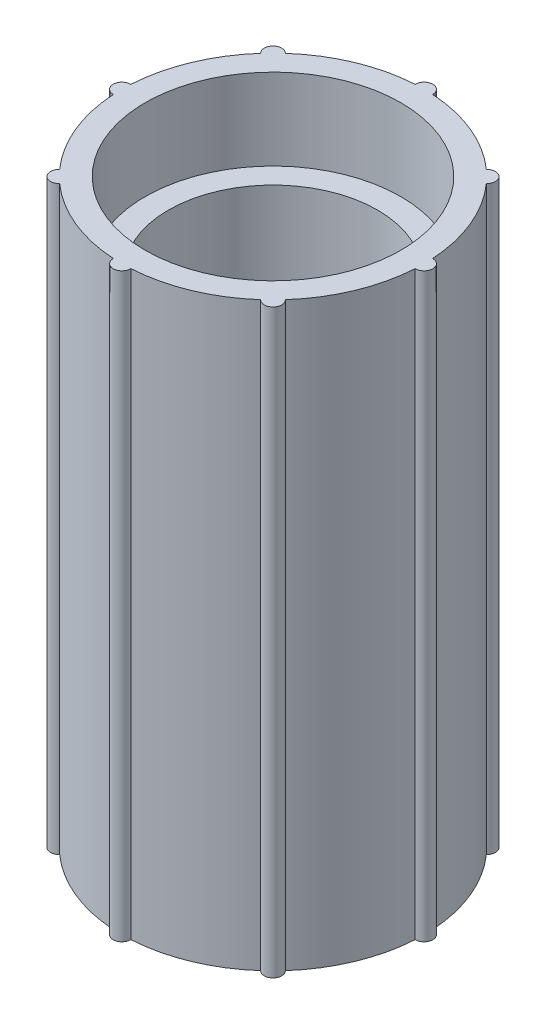
ISO-10303-21;
HEADER;
FILE_DESCRIPTION(('STEP AP214'),'2;1');
FILE_NAME('part.step','',(''),(''),'','','');
FILE_SCHEMA(('AUTOMOTIVE_DESIGN { 1 0 10303 214 1 1 1 1 }'));
ENDSEC;
DATA;
#1=APPLICATION_CONTEXT('core data for automotive mechanical design processes');
#2=APPLICATION_PROTOCOL_DEFINITION('international standard','automotive_design',2000,#1);
#3=PRODUCT_CONTEXT('',#1,'mechanical');
#4=PRODUCT('Part','Part','',(#3));
#5=PRODUCT_RELATED_PRODUCT_CATEGORY('part','',(#4));
#6=PRODUCT_DEFINITION_FORMATION('','',#4);
#7=PRODUCT_DEFINITION_CONTEXT('part definition',#1,'design');
#8=PRODUCT_DEFINITION('design','',#6,#7);
#9=PRODUCT_DEFINITION_SHAPE('','',#8);
#10=(LENGTH_UNIT() NAMED_UNIT(*) SI_UNIT(.MILLI.,.METRE.));
#11=(NAMED_UNIT(*) PLANE_ANGLE_UNIT() SI_UNIT($,.RADIAN.));
#12=(NAMED_UNIT(*) SI_UNIT($,.STERADIAN.) SOLID_ANGLE_UNIT());
#13=UNCERTAINTY_MEASURE_WITH_UNIT(LENGTH_MEASURE(1.E-05),#10,'distance_accuracy_value','');
#14=(GEOMETRIC_REPRESENTATION_CONTEXT(3) GLOBAL_UNCERTAINTY_ASSIGNED_CONTEXT((#13)) GLOBAL_UNIT_ASSIGNED_CONTEXT((#10,
#11,#12)) REPRESENTATION_CONTEXT('',''));
#15=CARTESIAN_POINT('',(0.,0.,0.));
#16=DIRECTION('',(0.,0.,1.));
#17=DIRECTION('',(1.,0.,0.));
#18=AXIS2_PLACEMENT_3D('',#15,#16,#17);
#19=CARTESIAN_POINT('',(0.,25.,0.));
#20=DIRECTION('',(0.,-1.,0.));
#21=DIRECTION('',(0.,0.,-1.));
#22=AXIS2_PLACEMENT_3D('',#19,#20,#21);
#23=CYLINDRICAL_SURFACE('',#22,13.);
#24=DIRECTION('',(0.,-1.,0.));
#25=VECTOR('',#24,1.);
#26=CARTESIAN_POINT('',(8.64698077619624,12.5,9.70719956816036));
#27=LINE('',#26,#25);
#28=CARTESIAN_POINT('',(8.64698077619625,0.,9.70719956816034));
#29=VERTEX_POINT('',#28);
#30=CARTESIAN_POINT('',(8.64698077619624,50.,9.70719956816036));
#31=VERTEX_POINT('',#30);
#32=EDGE_CURVE('E152',#29,#31,#27,.F.);
#33=ORIENTED_EDGE('',*,*,#32,.T.);
#34=CARTESIAN_POINT('',(0.,50.,0.));
#35=DIRECTION('',(0.,1.,0.));
#36=DIRECTION('',(0.,0.,1.));
#37=AXIS2_PLACEMENT_3D('',#34,#35,#36);
#38=CIRCLE('',#37,13.);
#39=CARTESIAN_POINT('',(0.749687897339529,50.,12.9783653846154));
#40=VERTEX_POINT('',#39);
#41=EDGE_CURVE('E155',#40,#31,#38,.T.);
#42=ORIENTED_EDGE('',*,*,#41,.F.);
#43=DIRECTION('',(0.,-1.,0.));
#44=VECTOR('',#43,1.);
#45=CARTESIAN_POINT('',(0.749687897339529,12.5,12.9783653846154));
#46=LINE('',#45,#44);
#47=CARTESIAN_POINT('',(0.749687897339529,0.,12.9783653846154));
#48=VERTEX_POINT('',#47);
#49=EDGE_CURVE('E191',#40,#48,#46,.T.);
#50=ORIENTED_EDGE('',*,*,#49,.T.);
#51=CARTESIAN_POINT('',(0.,0.,0.));
#52=DIRECTION('',(0.,1.,0.));
#53=DIRECTION('',(0.,0.,1.));
#54=AXIS2_PLACEMENT_3D('',#51,#52,#53);
#55=CIRCLE('',#54,13.);
#56=EDGE_CURVE('E57',#48,#29,#55,.T.);
#57=ORIENTED_EDGE('',*,*,#56,.T.);
#58=EDGE_LOOP('',(#33,#42,#50,#57));
#59=FACE_BOUND('',#58,.T.);
#60=ADVANCED_FACE('F39',(#59),#23,.T.);
#61=CARTESIAN_POINT('',(9.70719956816057,50.,8.646980776196));
#62=VERTEX_POINT('',#61);
#63=CARTESIAN_POINT('',(12.9783653846154,50.,0.749687897339393));
#64=VERTEX_POINT('',#63);
#65=EDGE_CURVE('E176',#62,#64,#38,.T.);
#66=ORIENTED_EDGE('',*,*,#65,.F.);
#67=DIRECTION('',(0.,-1.,0.));
#68=VECTOR('',#67,1.);
#69=CARTESIAN_POINT('',(9.70719956816057,12.5,8.646980776196));
#70=LINE('',#69,#68);
#71=CARTESIAN_POINT('',(9.70719956816057,0.,8.646980776196));
#72=VERTEX_POINT('',#71);
#73=EDGE_CURVE('E160',#62,#72,#70,.T.);
#74=ORIENTED_EDGE('',*,*,#73,.T.);
#75=CARTESIAN_POINT('',(12.9783653846154,0.,0.749687897339376));
#76=VERTEX_POINT('',#75);
#77=EDGE_CURVE('E50',#72,#76,#55,.T.);
#78=ORIENTED_EDGE('',*,*,#77,.T.);
#79=DIRECTION('',(0.,-1.,0.));
#80=VECTOR('',#79,1.);
#81=CARTESIAN_POINT('',(12.9783653846154,12.5,0.749687897339393));
#82=LINE('',#81,#80);
#83=EDGE_CURVE('E239',#76,#64,#82,.F.);
#84=ORIENTED_EDGE('',*,*,#83,.T.);
#85=EDGE_LOOP('',(#66,#74,#78,#84));
#86=FACE_BOUND('',#85,.T.);
#87=ADVANCED_FACE('F314',(#86),#23,.T.);
#88=DIRECTION('',(0.,-1.,0.));
#89=VECTOR('',#88,1.);
#90=CARTESIAN_POINT('',(-0.749687897339257,12.5,12.9783653846154));
#91=LINE('',#90,#89);
#92=CARTESIAN_POINT('',(-0.74968789733924,0.,12.9783653846154));
#93=VERTEX_POINT('',#92);
#94=CARTESIAN_POINT('',(-0.749687897339257,50.,12.9783653846154));
#95=VERTEX_POINT('',#94);
#96=EDGE_CURVE('E193',#93,#95,#91,.F.);
#97=ORIENTED_EDGE('',*,*,#96,.T.);
#98=CARTESIAN_POINT('',(-8.64698077619604,50.,9.70719956816054));
#99=VERTEX_POINT('',#98);
#100=EDGE_CURVE('E175',#99,#95,#38,.T.);
#101=ORIENTED_EDGE('',*,*,#100,.F.);
#102=DIRECTION('',(0.,-1.,0.));
#103=VECTOR('',#102,1.);
#104=CARTESIAN_POINT('',(-8.64698077619604,12.5,9.70719956816054));
#105=LINE('',#104,#103);
#106=CARTESIAN_POINT('',(-8.64698077619604,0.,9.70719956816054));
#107=VERTEX_POINT('',#106);
#108=EDGE_CURVE('E198',#99,#107,#105,.T.);
#109=ORIENTED_EDGE('',*,*,#108,.T.);
#110=EDGE_CURVE('E65',#107,#93,#55,.T.);
#111=ORIENTED_EDGE('',*,*,#110,.T.);
#112=EDGE_LOOP('',(#97,#101,#109,#111));
#113=FACE_BOUND('',#112,.T.);
#114=ADVANCED_FACE('F319',(#113),#23,.T.);
#115=DIRECTION('',(0.,-1.,0.));
#116=VECTOR('',#115,1.);
#117=CARTESIAN_POINT('',(-9.70719956816039,12.5,8.64698077619621));
#118=LINE('',#117,#116);
#119=CARTESIAN_POINT('',(-9.70719956816037,0.,8.64698077619622));
#120=VERTEX_POINT('',#119);
#121=CARTESIAN_POINT('',(-9.70719956816039,50.,8.64698077619621));
#122=VERTEX_POINT('',#121);
#123=EDGE_CURVE('E200',#120,#122,#118,.F.);
#124=ORIENTED_EDGE('',*,*,#123,.T.);
#125=CARTESIAN_POINT('',(-12.9783653846154,50.,0.749687897339393));
#126=VERTEX_POINT('',#125);
#127=EDGE_CURVE('E178',#126,#122,#38,.T.);
#128=ORIENTED_EDGE('',*,*,#127,.F.);
#129=DIRECTION('',(0.,-1.,0.));
#130=VECTOR('',#129,1.);
#131=CARTESIAN_POINT('',(-12.9783653846154,12.5,0.749687897339393));
#132=LINE('',#131,#130);
#133=CARTESIAN_POINT('',(-12.9783653846154,0.,0.749687897339393));
#134=VERTEX_POINT('',#133);
#135=EDGE_CURVE('E205',#126,#134,#132,.T.);
#136=ORIENTED_EDGE('',*,*,#135,.T.);
#137=EDGE_CURVE('E253',#134,#120,#55,.T.);
#138=ORIENTED_EDGE('',*,*,#137,.T.);
#139=EDGE_LOOP('',(#124,#128,#136,#138));
#140=FACE_BOUND('',#139,.T.);
#141=ADVANCED_FACE('F476',(#140),#23,.T.);
#142=DIRECTION('',(0.,-1.,0.));
#143=VECTOR('',#142,1.);
#144=CARTESIAN_POINT('',(-12.9783653846154,12.5,-0.749687897339393));
#145=LINE('',#144,#143);
#146=CARTESIAN_POINT('',(-12.9783653846154,0.,-0.749687897339376));
#147=VERTEX_POINT('',#146);
#148=CARTESIAN_POINT('',(-12.9783653846154,50.,-0.749687897339393));
#149=VERTEX_POINT('',#148);
#150=EDGE_CURVE('E208',#147,#149,#145,.F.);
#151=ORIENTED_EDGE('',*,*,#150,.T.);
#152=CARTESIAN_POINT('',(-9.70719956816051,50.,-8.64698077619607));
#153=VERTEX_POINT('',#152);
#154=EDGE_CURVE('E358',#153,#149,#38,.T.);
#155=ORIENTED_EDGE('',*,*,#154,.F.);
#156=DIRECTION('',(0.,-1.,0.));
#157=VECTOR('',#156,1.);
#158=CARTESIAN_POINT('',(-9.70719956816051,12.5,-8.64698077619607));
#159=LINE('',#158,#157);
#160=CARTESIAN_POINT('',(-9.70719956816051,0.,-8.64698077619607));
#161=VERTEX_POINT('',#160);
#162=EDGE_CURVE('E213',#153,#161,#159,.T.);
#163=ORIENTED_EDGE('',*,*,#162,.T.);
#164=EDGE_CURVE('E254',#161,#147,#55,.T.);
#165=ORIENTED_EDGE('',*,*,#164,.T.);
#166=EDGE_LOOP('',(#151,#155,#163,#165));
#167=FACE_BOUND('',#166,.T.);
#168=ADVANCED_FACE('F359',(#167),#23,.T.);
#169=DIRECTION('',(0.,-1.,0.));
#170=VECTOR('',#169,1.);
#171=CARTESIAN_POINT('',(-8.64698077619617,12.5,-9.70719956816041));
#172=LINE('',#171,#170);
#173=CARTESIAN_POINT('',(-8.64698077619619,0.,-9.7071995681604));
#174=VERTEX_POINT('',#173);
#175=CARTESIAN_POINT('',(-8.64698077619617,50.,-9.70719956816041));
#176=VERTEX_POINT('',#175);
#177=EDGE_CURVE('E216',#174,#176,#172,.F.);
#178=ORIENTED_EDGE('',*,*,#177,.T.);
#179=CARTESIAN_POINT('',(-0.749687897339438,50.,-12.9783653846154));
#180=VERTEX_POINT('',#179);
#181=EDGE_CURVE('E280',#180,#176,#38,.T.);
#182=ORIENTED_EDGE('',*,*,#181,.F.);
#183=DIRECTION('',(0.,-1.,0.));
#184=VECTOR('',#183,1.);
#185=CARTESIAN_POINT('',(-0.749687897339438,12.5,-12.9783653846154));
#186=LINE('',#185,#184);
#187=CARTESIAN_POINT('',(-0.749687897339438,0.,-12.9783653846154));
#188=VERTEX_POINT('',#187);
#189=EDGE_CURVE('E221',#180,#188,#186,.T.);
#190=ORIENTED_EDGE('',*,*,#189,.T.);
#191=EDGE_CURVE('E257',#188,#174,#55,.T.);
#192=ORIENTED_EDGE('',*,*,#191,.T.);
#193=EDGE_LOOP('',(#178,#182,#190,#192));
#194=FACE_BOUND('',#193,.T.);
#195=ADVANCED_FACE('F278',(#194),#23,.T.);
#196=DIRECTION('',(0.,-1.,0.));
#197=VECTOR('',#196,1.);
#198=CARTESIAN_POINT('',(0.749687897339348,12.5,-12.9783653846154));
#199=LINE('',#198,#197);
#200=CARTESIAN_POINT('',(0.749687897339331,0.,-12.9783653846154));
#201=VERTEX_POINT('',#200);
#202=CARTESIAN_POINT('',(0.749687897339348,50.,-12.9783653846154));
#203=VERTEX_POINT('',#202);
#204=EDGE_CURVE('E224',#201,#203,#199,.F.);
#205=ORIENTED_EDGE('',*,*,#204,.T.);
#206=CARTESIAN_POINT('',(8.64698077619611,50.,-9.70719956816048));
#207=VERTEX_POINT('',#206);
#208=EDGE_CURVE('E184',#207,#203,#38,.T.);
#209=ORIENTED_EDGE('',*,*,#208,.F.);
#210=DIRECTION('',(0.,-1.,0.));
#211=VECTOR('',#210,1.);
#212=CARTESIAN_POINT('',(8.64698077619611,12.5,-9.70719956816048));
#213=LINE('',#212,#211);
#214=CARTESIAN_POINT('',(8.64698077619611,0.,-9.70719956816048));
#215=VERTEX_POINT('',#214);
#216=EDGE_CURVE('E229',#207,#215,#213,.T.);
#217=ORIENTED_EDGE('',*,*,#216,.T.);
#218=EDGE_CURVE('E48',#215,#201,#55,.T.);
#219=ORIENTED_EDGE('',*,*,#218,.T.);
#220=EDGE_LOOP('',(#205,#209,#217,#219));
#221=FACE_BOUND('',#220,.T.);
#222=ADVANCED_FACE('F264',(#221),#23,.T.);
#223=DIRECTION('',(0.,-1.,0.));
#224=VECTOR('',#223,1.);
#225=CARTESIAN_POINT('',(9.70719956816045,12.5,-8.64698077619614));
#226=LINE('',#225,#224);
#227=CARTESIAN_POINT('',(9.70719956816043,0.,-8.64698077619615));
#228=VERTEX_POINT('',#227);
#229=CARTESIAN_POINT('',(9.70719956816045,50.,-8.64698077619614));
#230=VERTEX_POINT('',#229);
#231=EDGE_CURVE('E232',#228,#230,#226,.F.);
#232=ORIENTED_EDGE('',*,*,#231,.T.);
#233=CARTESIAN_POINT('',(12.9783653846154,50.,-0.749687897339393));
#234=VERTEX_POINT('',#233);
#235=EDGE_CURVE('E179',#234,#230,#38,.T.);
#236=ORIENTED_EDGE('',*,*,#235,.F.);
#237=DIRECTION('',(0.,-1.,0.));
#238=VECTOR('',#237,1.);
#239=CARTESIAN_POINT('',(12.9783653846154,12.5,-0.749687897339393));
#240=LINE('',#239,#238);
#241=CARTESIAN_POINT('',(12.9783653846154,0.,-0.749687897339393));
#242=VERTEX_POINT('',#241);
#243=EDGE_CURVE('E237',#234,#242,#240,.T.);
#244=ORIENTED_EDGE('',*,*,#243,.T.);
#245=EDGE_CURVE('E11',#242,#228,#55,.T.);
#246=ORIENTED_EDGE('',*,*,#245,.T.);
#247=EDGE_LOOP('',(#232,#236,#244,#246));
#248=FACE_BOUND('',#247,.T.);
#249=ADVANCED_FACE('F41',(#248),#23,.T.);
#250=CARTESIAN_POINT('',(0.,25.,0.));
#251=DIRECTION('',(0.,-1.,0.));
#252=DIRECTION('',(0.,0.,-1.));
#253=AXIS2_PLACEMENT_3D('',#250,#251,#252);
#254=CYLINDRICAL_SURFACE('',#253,9.);
#255=CARTESIAN_POINT('',(0.,7.,0.));
#256=DIRECTION('',(0.,-1.,0.));
#257=DIRECTION('',(0.,0.,-1.));
#258=AXIS2_PLACEMENT_3D('',#255,#256,#257);
#259=CIRCLE('',#258,9.);
#260=CARTESIAN_POINT('',(0.,7.,-9.));
#261=VERTEX_POINT('',#260);
#262=EDGE_CURVE('E246',#261,#261,#259,.F.);
#263=ORIENTED_EDGE('',*,*,#262,.F.);
#264=EDGE_LOOP('',(#263));
#265=FACE_BOUND('',#264,.T.);
#266=CARTESIAN_POINT('',(0.,43.,0.));
#267=DIRECTION('',(0.,1.,0.));
#268=DIRECTION('',(0.,0.,1.));
#269=AXIS2_PLACEMENT_3D('',#266,#267,#268);
#270=CIRCLE('',#269,9.);
#271=CARTESIAN_POINT('',(0.,43.,9.));
#272=VERTEX_POINT('',#271);
#273=EDGE_CURVE('E43',#272,#272,#270,.F.);
#274=ORIENTED_EDGE('',*,*,#273,.F.);
#275=EDGE_LOOP('',(#274));
#276=FACE_BOUND('',#275,.T.);
#277=ADVANCED_FACE('F321',(#265,#276),#254,.F.);
#278=CARTESIAN_POINT('',(0.,0.,0.));
#279=DIRECTION('',(0.,1.,0.));
#280=DIRECTION('',(0.,0.,1.));
#281=AXIS2_PLACEMENT_3D('',#278,#279,#280);
#282=PLANE('',#281);
#283=CARTESIAN_POINT('',(0.,0.,0.));
#284=DIRECTION('',(0.,-1.,0.));
#285=DIRECTION('',(0.,0.,-1.));
#286=AXIS2_PLACEMENT_3D('',#283,#284,#285);
#287=CIRCLE('',#286,11.);
#288=CARTESIAN_POINT('',(0.,0.,-11.));
#289=VERTEX_POINT('',#288);
#290=EDGE_CURVE('E242',#289,#289,#287,.T.);
#291=ORIENTED_EDGE('',*,*,#290,.F.);
#292=EDGE_LOOP('',(#291));
#293=FACE_BOUND('',#292,.T.);
#294=ORIENTED_EDGE('',*,*,#77,.F.);
#295=CARTESIAN_POINT('',(9.19238815542523,0.,9.192388155425));
#296=DIRECTION('',(0.,-1.,0.));
#297=DIRECTION('',(0.707106781186539,0.,-0.707106781186556));
#298=AXIS2_PLACEMENT_3D('',#295,#296,#297);
#299=CIRCLE('',#298,0.75);
#300=EDGE_CURVE('E183',#72,#29,#299,.T.);
#301=ORIENTED_EDGE('',*,*,#300,.T.);
#302=ORIENTED_EDGE('',*,*,#56,.F.);
#303=CARTESIAN_POINT('',(1.36167772214882E-13,0.,13.));
#304=DIRECTION('',(0.,-1.,0.));
#305=DIRECTION('',(1.,0.,0.));
#306=AXIS2_PLACEMENT_3D('',#303,#304,#305);
#307=CIRCLE('',#306,0.75);
#308=EDGE_CURVE('E159',#48,#93,#307,.T.);
#309=ORIENTED_EDGE('',*,*,#308,.T.);
#310=ORIENTED_EDGE('',*,*,#110,.F.);
#311=CARTESIAN_POINT('',(-9.19238815542504,0.,9.1923881554252));
#312=DIRECTION('',(0.,-1.,0.));
#313=DIRECTION('',(0.707106781186554,0.,0.707106781186541));
#314=AXIS2_PLACEMENT_3D('',#311,#312,#313);
#315=CIRCLE('',#314,0.75);
#316=EDGE_CURVE('E195',#107,#120,#315,.T.);
#317=ORIENTED_EDGE('',*,*,#316,.T.);
#318=ORIENTED_EDGE('',*,*,#137,.F.);
#319=CARTESIAN_POINT('',(-13.,0.,0.));
#320=DIRECTION('',(0.,-1.,0.));
#321=DIRECTION('',(0.,0.,1.));
#322=AXIS2_PLACEMENT_3D('',#319,#320,#321);
#323=CIRCLE('',#322,0.75);
#324=EDGE_CURVE('E202',#134,#147,#323,.T.);
#325=ORIENTED_EDGE('',*,*,#324,.T.);
#326=ORIENTED_EDGE('',*,*,#164,.F.);
#327=CARTESIAN_POINT('',(-9.19238815542517,0.,-9.19238815542507));
#328=DIRECTION('',(0.,-1.,0.));
#329=DIRECTION('',(-0.707106781186544,0.,0.707106781186551));
#330=AXIS2_PLACEMENT_3D('',#327,#328,#329);
#331=CIRCLE('',#330,0.75);
#332=EDGE_CURVE('E210',#161,#174,#331,.T.);
#333=ORIENTED_EDGE('',*,*,#332,.T.);
#334=ORIENTED_EDGE('',*,*,#191,.F.);
#335=CARTESIAN_POINT('',(0.,0.,-13.));
#336=DIRECTION('',(0.,-1.,0.));
#337=DIRECTION('',(-1.,0.,0.));
#338=AXIS2_PLACEMENT_3D('',#335,#336,#337);
#339=CIRCLE('',#338,0.75);
#340=EDGE_CURVE('E218',#188,#201,#339,.T.);
#341=ORIENTED_EDGE('',*,*,#340,.T.);
#342=ORIENTED_EDGE('',*,*,#218,.F.);
#343=CARTESIAN_POINT('',(9.1923881554251,0.,-9.19238815542513));
#344=DIRECTION('',(0.,-1.,0.));
#345=DIRECTION('',(-0.707106781186549,0.,-0.707106781186546));
#346=AXIS2_PLACEMENT_3D('',#343,#344,#345);
#347=CIRCLE('',#346,0.75);
#348=EDGE_CURVE('E226',#215,#228,#347,.T.);
#349=ORIENTED_EDGE('',*,*,#348,.T.);
#350=ORIENTED_EDGE('',*,*,#245,.F.);
#351=CARTESIAN_POINT('',(13.,0.,0.));
#352=DIRECTION('',(0.,-1.,0.));
#353=DIRECTION('',(0.,0.,-1.));
#354=AXIS2_PLACEMENT_3D('',#351,#352,#353);
#355=CIRCLE('',#354,0.75);
#356=EDGE_CURVE('E234',#242,#76,#355,.T.);
#357=ORIENTED_EDGE('',*,*,#356,.T.);
#358=EDGE_LOOP('',(#294,#301,#302,#309,#310,#317,#318,#325,#326,#333,#334,#341,#342,#349,#350,#357));
#359=FACE_BOUND('',#358,.T.);
#360=ADVANCED_FACE('F275',(#293,#359),#282,.F.);
#361=CARTESIAN_POINT('',(0.,7.,0.));
#362=DIRECTION('',(0.,-1.,0.));
#363=DIRECTION('',(0.,0.,-1.));
#364=AXIS2_PLACEMENT_3D('',#361,#362,#363);
#365=PLANE('',#364);
#366=CARTESIAN_POINT('',(0.,7.,0.));
#367=DIRECTION('',(0.,-1.,0.));
#368=DIRECTION('',(0.,0.,-1.));
#369=AXIS2_PLACEMENT_3D('',#366,#367,#368);
#370=CIRCLE('',#369,11.);
#371=CARTESIAN_POINT('',(0.,7.,-11.));
#372=VERTEX_POINT('',#371);
#373=EDGE_CURVE('E243',#372,#372,#370,.T.);
#374=ORIENTED_EDGE('',*,*,#373,.T.);
#375=EDGE_LOOP('',(#374));
#376=FACE_BOUND('',#375,.T.);
#377=ORIENTED_EDGE('',*,*,#262,.T.);
#378=EDGE_LOOP('',(#377));
#379=FACE_BOUND('',#378,.T.);
#380=ADVANCED_FACE('F378',(#376,#379),#365,.T.);
#381=CARTESIAN_POINT('',(0.,7.,0.));
#382=DIRECTION('',(0.,-1.,0.));
#383=DIRECTION('',(0.,0.,-1.));
#384=AXIS2_PLACEMENT_3D('',#381,#382,#383);
#385=CYLINDRICAL_SURFACE('',#384,11.);
#386=ORIENTED_EDGE('',*,*,#373,.F.);
#387=EDGE_LOOP('',(#386));
#388=FACE_BOUND('',#387,.T.);
#389=ORIENTED_EDGE('',*,*,#290,.T.);
#390=EDGE_LOOP('',(#389));
#391=FACE_BOUND('',#390,.T.);
#392=ADVANCED_FACE('F377',(#388,#391),#385,.F.);
#393=CARTESIAN_POINT('',(13.,25.,0.));
#394=DIRECTION('',(0.,-1.,0.));
#395=DIRECTION('',(0.,0.,-1.));
#396=AXIS2_PLACEMENT_3D('',#393,#394,#395);
#397=CYLINDRICAL_SURFACE('',#396,0.75);
#398=CARTESIAN_POINT('',(13.,50.,0.));
#399=DIRECTION('',(0.,-1.,0.));
#400=DIRECTION('',(0.,0.,-1.));
#401=AXIS2_PLACEMENT_3D('',#398,#399,#400);
#402=CIRCLE('',#401,0.75);
#403=EDGE_CURVE('E287',#234,#64,#402,.T.);
#404=ORIENTED_EDGE('',*,*,#403,.T.);
#405=ORIENTED_EDGE('',*,*,#83,.F.);
#406=ORIENTED_EDGE('',*,*,#356,.F.);
#407=ORIENTED_EDGE('',*,*,#243,.F.);
#408=EDGE_LOOP('',(#404,#405,#406,#407));
#409=FACE_BOUND('',#408,.T.);
#410=ADVANCED_FACE('F336',(#409),#397,.T.);
#411=CARTESIAN_POINT('',(9.1923881554251,25.,-9.19238815542513));
#412=DIRECTION('',(0.,-1.,0.));
#413=DIRECTION('',(0.,0.,-1.));
#414=AXIS2_PLACEMENT_3D('',#411,#412,#413);
#415=CYLINDRICAL_SURFACE('',#414,0.75);
#416=ORIENTED_EDGE('',*,*,#231,.F.);
#417=ORIENTED_EDGE('',*,*,#348,.F.);
#418=ORIENTED_EDGE('',*,*,#216,.F.);
#419=CARTESIAN_POINT('',(9.1923881554251,50.,-9.19238815542513));
#420=DIRECTION('',(0.,-1.,0.));
#421=DIRECTION('',(-0.707106781186549,0.,-0.707106781186546));
#422=AXIS2_PLACEMENT_3D('',#419,#420,#421);
#423=CIRCLE('',#422,0.75);
#424=EDGE_CURVE('E283',#207,#230,#423,.T.);
#425=ORIENTED_EDGE('',*,*,#424,.T.);
#426=EDGE_LOOP('',(#416,#417,#418,#425));
#427=FACE_BOUND('',#426,.T.);
#428=ADVANCED_FACE('F333',(#427),#415,.T.);
#429=CARTESIAN_POINT('',(0.,25.,-13.));
#430=DIRECTION('',(0.,-1.,0.));
#431=DIRECTION('',(0.,0.,-1.));
#432=AXIS2_PLACEMENT_3D('',#429,#430,#431);
#433=CYLINDRICAL_SURFACE('',#432,0.75);
#434=ORIENTED_EDGE('',*,*,#204,.F.);
#435=ORIENTED_EDGE('',*,*,#340,.F.);
#436=ORIENTED_EDGE('',*,*,#189,.F.);
#437=CARTESIAN_POINT('',(0.,50.,-13.));
#438=DIRECTION('',(0.,-1.,0.));
#439=DIRECTION('',(-1.,0.,0.));
#440=AXIS2_PLACEMENT_3D('',#437,#438,#439);
#441=CIRCLE('',#440,0.75);
#442=EDGE_CURVE('E273',#180,#203,#441,.T.);
#443=ORIENTED_EDGE('',*,*,#442,.T.);
#444=EDGE_LOOP('',(#434,#435,#436,#443));
#445=FACE_BOUND('',#444,.T.);
#446=ADVANCED_FACE('F271',(#445),#433,.T.);
#447=CARTESIAN_POINT('',(-9.19238815542517,25.,-9.19238815542507));
#448=DIRECTION('',(0.,-1.,0.));
#449=DIRECTION('',(0.,0.,-1.));
#450=AXIS2_PLACEMENT_3D('',#447,#448,#449);
#451=CYLINDRICAL_SURFACE('',#450,0.75);
#452=ORIENTED_EDGE('',*,*,#177,.F.);
#453=ORIENTED_EDGE('',*,*,#332,.F.);
#454=ORIENTED_EDGE('',*,*,#162,.F.);
#455=CARTESIAN_POINT('',(-9.19238815542517,50.,-9.19238815542507));
#456=DIRECTION('',(0.,-1.,0.));
#457=DIRECTION('',(-0.707106781186544,0.,0.707106781186551));
#458=AXIS2_PLACEMENT_3D('',#455,#456,#457);
#459=CIRCLE('',#458,0.75);
#460=EDGE_CURVE('E284',#153,#176,#459,.T.);
#461=ORIENTED_EDGE('',*,*,#460,.T.);
#462=EDGE_LOOP('',(#452,#453,#454,#461));
#463=FACE_BOUND('',#462,.T.);
#464=ADVANCED_FACE('F361',(#463),#451,.T.);
#465=CARTESIAN_POINT('',(-13.,25.,0.));
#466=DIRECTION('',(0.,-1.,0.));
#467=DIRECTION('',(0.,0.,-1.));
#468=AXIS2_PLACEMENT_3D('',#465,#466,#467);
#469=CYLINDRICAL_SURFACE('',#468,0.75);
#470=ORIENTED_EDGE('',*,*,#150,.F.);
#471=ORIENTED_EDGE('',*,*,#324,.F.);
#472=ORIENTED_EDGE('',*,*,#135,.F.);
#473=CARTESIAN_POINT('',(-13.,50.,0.));
#474=DIRECTION('',(0.,-1.,0.));
#475=DIRECTION('',(0.,0.,1.));
#476=AXIS2_PLACEMENT_3D('',#473,#474,#475);
#477=CIRCLE('',#476,0.75);
#478=EDGE_CURVE('E290',#126,#149,#477,.T.);
#479=ORIENTED_EDGE('',*,*,#478,.T.);
#480=EDGE_LOOP('',(#470,#471,#472,#479));
#481=FACE_BOUND('',#480,.T.);
#482=ADVANCED_FACE('F355',(#481),#469,.T.);
#483=CARTESIAN_POINT('',(-9.19238815542504,25.,9.1923881554252));
#484=DIRECTION('',(0.,-1.,0.));
#485=DIRECTION('',(0.,0.,-1.));
#486=AXIS2_PLACEMENT_3D('',#483,#484,#485);
#487=CYLINDRICAL_SURFACE('',#486,0.75);
#488=ORIENTED_EDGE('',*,*,#123,.F.);
#489=ORIENTED_EDGE('',*,*,#316,.F.);
#490=ORIENTED_EDGE('',*,*,#108,.F.);
#491=CARTESIAN_POINT('',(-9.19238815542504,50.,9.1923881554252));
#492=DIRECTION('',(0.,-1.,0.));
#493=DIRECTION('',(0.707106781186554,0.,0.707106781186541));
#494=AXIS2_PLACEMENT_3D('',#491,#492,#493);
#495=CIRCLE('',#494,0.75);
#496=EDGE_CURVE('E346',#99,#122,#495,.T.);
#497=ORIENTED_EDGE('',*,*,#496,.T.);
#498=EDGE_LOOP('',(#488,#489,#490,#497));
#499=FACE_BOUND('',#498,.T.);
#500=ADVANCED_FACE('F368',(#499),#487,.T.);
#501=CARTESIAN_POINT('',(1.36167772214882E-13,25.,13.));
#502=DIRECTION('',(0.,-1.,0.));
#503=DIRECTION('',(0.,0.,-1.));
#504=AXIS2_PLACEMENT_3D('',#501,#502,#503);
#505=CYLINDRICAL_SURFACE('',#504,0.75);
#506=ORIENTED_EDGE('',*,*,#96,.F.);
#507=ORIENTED_EDGE('',*,*,#308,.F.);
#508=ORIENTED_EDGE('',*,*,#49,.F.);
#509=CARTESIAN_POINT('',(1.36167772214882E-13,50.,13.));
#510=DIRECTION('',(0.,-1.,0.));
#511=DIRECTION('',(1.,0.,0.));
#512=AXIS2_PLACEMENT_3D('',#509,#510,#511);
#513=CIRCLE('',#512,0.75);
#514=EDGE_CURVE('E168',#40,#95,#513,.T.);
#515=ORIENTED_EDGE('',*,*,#514,.T.);
#516=EDGE_LOOP('',(#506,#507,#508,#515));
#517=FACE_BOUND('',#516,.T.);
#518=ADVANCED_FACE('F340',(#517),#505,.T.);
#519=CARTESIAN_POINT('',(9.19238815542523,25.,9.192388155425));
#520=DIRECTION('',(0.,-1.,0.));
#521=DIRECTION('',(0.,0.,-1.));
#522=AXIS2_PLACEMENT_3D('',#519,#520,#521);
#523=CYLINDRICAL_SURFACE('',#522,0.75);
#524=ORIENTED_EDGE('',*,*,#32,.F.);
#525=ORIENTED_EDGE('',*,*,#300,.F.);
#526=ORIENTED_EDGE('',*,*,#73,.F.);
#527=CARTESIAN_POINT('',(9.19238815542523,50.,9.192388155425));
#528=DIRECTION('',(0.,-1.,0.));
#529=DIRECTION('',(0.707106781186539,0.,-0.707106781186556));
#530=AXIS2_PLACEMENT_3D('',#527,#528,#529);
#531=CIRCLE('',#530,0.75);
#532=EDGE_CURVE('E163',#62,#31,#531,.T.);
#533=ORIENTED_EDGE('',*,*,#532,.T.);
#534=EDGE_LOOP('',(#524,#525,#526,#533));
#535=FACE_BOUND('',#534,.T.);
#536=ADVANCED_FACE('F164',(#535),#523,.T.);
#537=CARTESIAN_POINT('',(0.,50.,0.));
#538=DIRECTION('',(0.,-1.,0.));
#539=DIRECTION('',(0.,0.,1.));
#540=AXIS2_PLACEMENT_3D('',#537,#538,#539);
#541=PLANE('',#540);
#542=ORIENTED_EDGE('',*,*,#41,.T.);
#543=ORIENTED_EDGE('',*,*,#532,.F.);
#544=ORIENTED_EDGE('',*,*,#65,.T.);
#545=ORIENTED_EDGE('',*,*,#403,.F.);
#546=ORIENTED_EDGE('',*,*,#235,.T.);
#547=ORIENTED_EDGE('',*,*,#424,.F.);
#548=ORIENTED_EDGE('',*,*,#208,.T.);
#549=ORIENTED_EDGE('',*,*,#442,.F.);
#550=ORIENTED_EDGE('',*,*,#181,.T.);
#551=ORIENTED_EDGE('',*,*,#460,.F.);
#552=ORIENTED_EDGE('',*,*,#154,.T.);
#553=ORIENTED_EDGE('',*,*,#478,.F.);
#554=ORIENTED_EDGE('',*,*,#127,.T.);
#555=ORIENTED_EDGE('',*,*,#496,.F.);
#556=ORIENTED_EDGE('',*,*,#100,.T.);
#557=ORIENTED_EDGE('',*,*,#514,.F.);
#558=EDGE_LOOP('',(#542,#543,#544,#545,#546,#547,#548,#549,#550,#551,#552,#553,#554,#555,#556,#557));
#559=FACE_BOUND('',#558,.T.);
#560=CARTESIAN_POINT('',(0.,50.,0.));
#561=DIRECTION('',(0.,-1.,0.));
#562=DIRECTION('',(0.,0.,-1.));
#563=AXIS2_PLACEMENT_3D('',#560,#561,#562);
#564=CIRCLE('',#563,11.);
#565=CARTESIAN_POINT('',(0.,50.,-11.));
#566=VERTEX_POINT('',#565);
#567=EDGE_CURVE('E185',#566,#566,#564,.T.);
#568=ORIENTED_EDGE('',*,*,#567,.T.);
#569=EDGE_LOOP('',(#568));
#570=FACE_BOUND('',#569,.T.);
#571=ADVANCED_FACE('F171',(#559,#570),#541,.F.);
#572=CARTESIAN_POINT('',(0.,43.,0.));
#573=DIRECTION('',(0.,1.,0.));
#574=DIRECTION('',(0.,0.,-1.));
#575=AXIS2_PLACEMENT_3D('',#572,#573,#574);
#576=PLANE('',#575);
#577=CARTESIAN_POINT('',(0.,43.,0.));
#578=DIRECTION('',(0.,-1.,0.));
#579=DIRECTION('',(0.,0.,-1.));
#580=AXIS2_PLACEMENT_3D('',#577,#578,#579);
#581=CIRCLE('',#580,11.);
#582=CARTESIAN_POINT('',(0.,43.,-11.));
#583=VERTEX_POINT('',#582);
#584=EDGE_CURVE('E295',#583,#583,#581,.T.);
#585=ORIENTED_EDGE('',*,*,#584,.F.);
#586=EDGE_LOOP('',(#585));
#587=FACE_BOUND('',#586,.T.);
#588=ORIENTED_EDGE('',*,*,#273,.T.);
#589=EDGE_LOOP('',(#588));
#590=FACE_BOUND('',#589,.T.);
#591=ADVANCED_FACE('F305',(#587,#590),#576,.T.);
#592=CARTESIAN_POINT('',(0.,43.,0.));
#593=DIRECTION('',(0.,1.,0.));
#594=DIRECTION('',(0.,0.,1.));
#595=AXIS2_PLACEMENT_3D('',#592,#593,#594);
#596=CYLINDRICAL_SURFACE('',#595,11.);
#597=ORIENTED_EDGE('',*,*,#584,.T.);
#598=EDGE_LOOP('',(#597));
#599=FACE_BOUND('',#598,.T.);
#600=ORIENTED_EDGE('',*,*,#567,.F.);
#601=EDGE_LOOP('',(#600));
#602=FACE_BOUND('',#601,.T.);
#603=ADVANCED_FACE('F303',(#599,#602),#596,.F.);
#604=CLOSED_SHELL('',(#60,#87,#114,#141,#168,#195,#222,#249,#277,#360,#380,#392,#410,#428,#446,
#464,#482,#500,#518,#536,#571,#591,#603));
#605=MANIFOLD_SOLID_BREP('B2',#604);
#606=ADVANCED_BREP_SHAPE_REPRESENTATION('',(#18,#605),#14);
#607=SHAPE_DEFINITION_REPRESENTATION(#9,#606);
ENDSEC;
END-ISO-10303-21;
